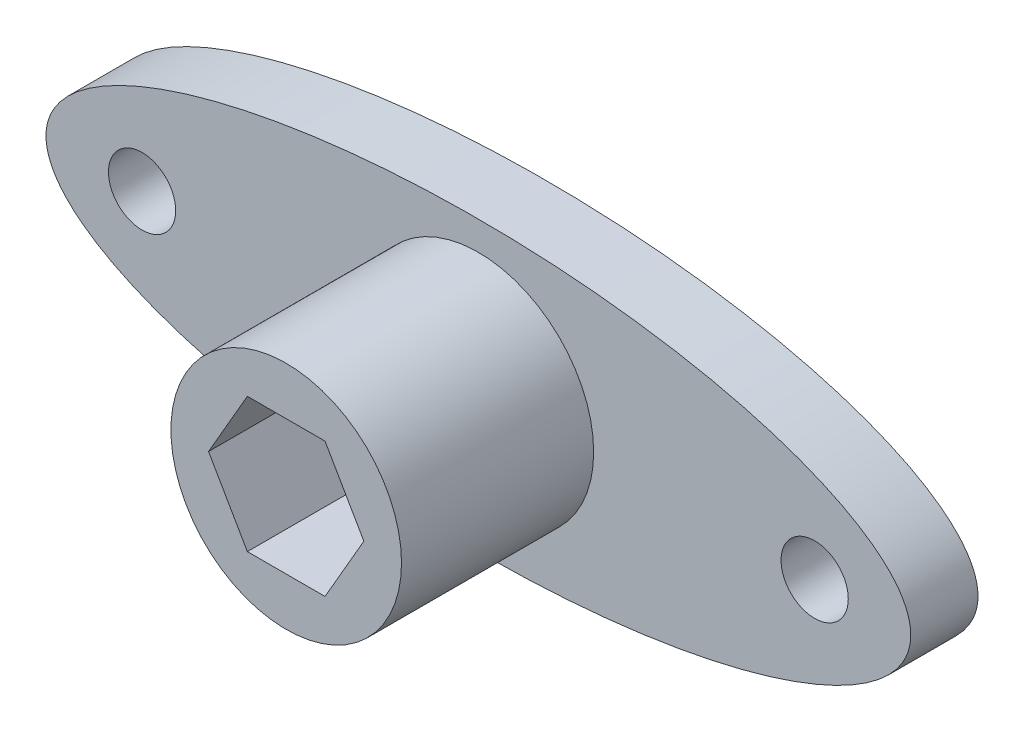
ISO-10303-21;
HEADER;
FILE_DESCRIPTION(('STEP AP214'),'2;1');
FILE_NAME('part.step','',(''),(''),'','','');
FILE_SCHEMA(('AUTOMOTIVE_DESIGN { 1 0 10303 214 1 1 1 1 }'));
ENDSEC;
DATA;
#1=APPLICATION_CONTEXT('core data for automotive mechanical design processes');
#2=APPLICATION_PROTOCOL_DEFINITION('international standard','automotive_design',2000,#1);
#3=PRODUCT_CONTEXT('',#1,'mechanical');
#4=PRODUCT('Part','Part','',(#3));
#5=PRODUCT_RELATED_PRODUCT_CATEGORY('part','',(#4));
#6=PRODUCT_DEFINITION_FORMATION('','',#4);
#7=PRODUCT_DEFINITION_CONTEXT('part definition',#1,'design');
#8=PRODUCT_DEFINITION('design','',#6,#7);
#9=PRODUCT_DEFINITION_SHAPE('','',#8);
#10=(LENGTH_UNIT() NAMED_UNIT(*) SI_UNIT(.MILLI.,.METRE.));
#11=(NAMED_UNIT(*) PLANE_ANGLE_UNIT() SI_UNIT($,.RADIAN.));
#12=(NAMED_UNIT(*) SI_UNIT($,.STERADIAN.) SOLID_ANGLE_UNIT());
#13=UNCERTAINTY_MEASURE_WITH_UNIT(LENGTH_MEASURE(1.E-05),#10,'distance_accuracy_value','');
#14=(GEOMETRIC_REPRESENTATION_CONTEXT(3) GLOBAL_UNCERTAINTY_ASSIGNED_CONTEXT((#13)) GLOBAL_UNIT_ASSIGNED_CONTEXT((#10,
#11,#12)) REPRESENTATION_CONTEXT('',''));
#15=CARTESIAN_POINT('',(0.,0.,0.));
#16=DIRECTION('',(0.,0.,1.));
#17=DIRECTION('',(1.,0.,0.));
#18=AXIS2_PLACEMENT_3D('',#15,#16,#17);
#19=CARTESIAN_POINT('',(0.,0.,3.5));
#20=DIRECTION('',(0.,0.,1.));
#21=DIRECTION('',(1.,0.,0.));
#22=AXIS2_PLACEMENT_3D('',#19,#20,#21);
#23=PLANE('',#22);
#24=CARTESIAN_POINT('',(0.,0.,3.5));
#25=DIRECTION('',(0.,0.,1.));
#26=DIRECTION('',(1.,0.,0.));
#27=AXIS2_PLACEMENT_3D('',#24,#25,#26);
#28=CIRCLE('',#27,6.);
#29=CARTESIAN_POINT('',(6.,0.,3.5));
#30=VERTEX_POINT('',#29);
#31=EDGE_CURVE('E164',#30,#30,#28,.T.);
#32=ORIENTED_EDGE('',*,*,#31,.F.);
#33=EDGE_LOOP('',(#32));
#34=FACE_BOUND('',#33,.T.);
#35=CARTESIAN_POINT('',(-17.5,0.,3.5));
#36=DIRECTION('',(0.,0.,1.));
#37=DIRECTION('',(1.,0.,0.));
#38=AXIS2_PLACEMENT_3D('',#35,#36,#37);
#39=CIRCLE('',#38,1.75);
#40=CARTESIAN_POINT('',(-15.75,0.,3.5));
#41=VERTEX_POINT('',#40);
#42=EDGE_CURVE('E181',#41,#41,#39,.T.);
#43=ORIENTED_EDGE('',*,*,#42,.F.);
#44=EDGE_LOOP('',(#43));
#45=FACE_BOUND('',#44,.T.);
#46=CARTESIAN_POINT('',(0.,0.,3.5));
#47=DIRECTION('',(0.,0.,1.));
#48=DIRECTION('',(1.,0.,0.));
#49=AXIS2_PLACEMENT_3D('',#46,#47,#48);
#50=ELLIPSE('',#49,22.5,7.5);
#51=CARTESIAN_POINT('',(22.5,0.,3.5));
#52=VERTEX_POINT('',#51);
#53=EDGE_CURVE('E13',#52,#52,#50,.T.);
#54=ORIENTED_EDGE('',*,*,#53,.T.);
#55=EDGE_LOOP('',(#54));
#56=FACE_BOUND('',#55,.T.);
#57=CARTESIAN_POINT('',(17.5,0.,3.5));
#58=DIRECTION('',(0.,0.,1.));
#59=DIRECTION('',(1.,0.,0.));
#60=AXIS2_PLACEMENT_3D('',#57,#58,#59);
#61=CIRCLE('',#60,1.75);
#62=CARTESIAN_POINT('',(19.25,0.,3.5));
#63=VERTEX_POINT('',#62);
#64=EDGE_CURVE('E173',#63,#63,#61,.T.);
#65=ORIENTED_EDGE('',*,*,#64,.F.);
#66=EDGE_LOOP('',(#65));
#67=FACE_BOUND('',#66,.T.);
#68=ADVANCED_FACE('F50',(#34,#45,#56,#67),#23,.T.);
#69=CARTESIAN_POINT('',(0.,0.,0.));
#70=DIRECTION('',(0.,0.,1.));
#71=DIRECTION('',(1.,0.,0.));
#72=AXIS2_PLACEMENT_3D('',#69,#70,#71);
#73=PLANE('',#72);
#74=CARTESIAN_POINT('',(0.,0.,0.));
#75=DIRECTION('',(0.,0.,1.));
#76=DIRECTION('',(1.,0.,0.));
#77=AXIS2_PLACEMENT_3D('',#74,#75,#76);
#78=ELLIPSE('',#77,22.5,7.5);
#79=CARTESIAN_POINT('',(22.5,0.,0.));
#80=VERTEX_POINT('',#79);
#81=EDGE_CURVE('E55',#80,#80,#78,.T.);
#82=ORIENTED_EDGE('',*,*,#81,.F.);
#83=EDGE_LOOP('',(#82));
#84=FACE_BOUND('',#83,.T.);
#85=CARTESIAN_POINT('',(-17.5,0.,0.));
#86=DIRECTION('',(0.,0.,1.));
#87=DIRECTION('',(1.,0.,0.));
#88=AXIS2_PLACEMENT_3D('',#85,#86,#87);
#89=CIRCLE('',#88,1.75);
#90=CARTESIAN_POINT('',(-15.75,0.,0.));
#91=VERTEX_POINT('',#90);
#92=EDGE_CURVE('E177',#91,#91,#89,.T.);
#93=ORIENTED_EDGE('',*,*,#92,.T.);
#94=EDGE_LOOP('',(#93));
#95=FACE_BOUND('',#94,.T.);
#96=CARTESIAN_POINT('',(17.5,0.,0.));
#97=DIRECTION('',(0.,0.,1.));
#98=DIRECTION('',(1.,0.,0.));
#99=AXIS2_PLACEMENT_3D('',#96,#97,#98);
#100=CIRCLE('',#99,1.75);
#101=CARTESIAN_POINT('',(19.25,0.,0.));
#102=VERTEX_POINT('',#101);
#103=EDGE_CURVE('E169',#102,#102,#100,.T.);
#104=ORIENTED_EDGE('',*,*,#103,.T.);
#105=EDGE_LOOP('',(#104));
#106=FACE_BOUND('',#105,.T.);
#107=ADVANCED_FACE('F190',(#84,#95,#106),#73,.F.);
#108=DIRECTION('',(0.,0.,-1.));
#109=VECTOR('',#108,1.);
#110=SURFACE_OF_LINEAR_EXTRUSION('',#50,#109);
#111=ORIENTED_EDGE('',*,*,#53,.F.);
#112=EDGE_LOOP('',(#111));
#113=FACE_BOUND('',#112,.T.);
#114=ORIENTED_EDGE('',*,*,#81,.T.);
#115=EDGE_LOOP('',(#114));
#116=FACE_BOUND('',#115,.T.);
#117=ADVANCED_FACE('F52',(#113,#116),#110,.F.);
#118=CARTESIAN_POINT('',(-17.5,0.,3.5));
#119=DIRECTION('',(0.,0.,-1.));
#120=DIRECTION('',(-1.,0.,0.));
#121=AXIS2_PLACEMENT_3D('',#118,#119,#120);
#122=CYLINDRICAL_SURFACE('',#121,1.75);
#123=ORIENTED_EDGE('',*,*,#42,.T.);
#124=EDGE_LOOP('',(#123));
#125=FACE_BOUND('',#124,.T.);
#126=ORIENTED_EDGE('',*,*,#92,.F.);
#127=EDGE_LOOP('',(#126));
#128=FACE_BOUND('',#127,.T.);
#129=ADVANCED_FACE('F193',(#125,#128),#122,.F.);
#130=CARTESIAN_POINT('',(17.5,0.,3.5));
#131=DIRECTION('',(0.,0.,-1.));
#132=DIRECTION('',(-1.,0.,0.));
#133=AXIS2_PLACEMENT_3D('',#130,#131,#132);
#134=CYLINDRICAL_SURFACE('',#133,1.75);
#135=ORIENTED_EDGE('',*,*,#64,.T.);
#136=EDGE_LOOP('',(#135));
#137=FACE_BOUND('',#136,.T.);
#138=ORIENTED_EDGE('',*,*,#103,.F.);
#139=EDGE_LOOP('',(#138));
#140=FACE_BOUND('',#139,.T.);
#141=ADVANCED_FACE('F195',(#137,#140),#134,.F.);
#142=CARTESIAN_POINT('',(0.,0.,13.5));
#143=DIRECTION('',(0.,0.,-1.));
#144=DIRECTION('',(-1.,0.,0.));
#145=AXIS2_PLACEMENT_3D('',#142,#143,#144);
#146=CYLINDRICAL_SURFACE('',#145,6.);
#147=CARTESIAN_POINT('',(0.,0.,13.5));
#148=DIRECTION('',(0.,0.,1.));
#149=DIRECTION('',(1.,0.,0.));
#150=AXIS2_PLACEMENT_3D('',#147,#148,#149);
#151=CIRCLE('',#150,6.);
#152=CARTESIAN_POINT('',(6.,0.,13.5));
#153=VERTEX_POINT('',#152);
#154=EDGE_CURVE('E165',#153,#153,#151,.T.);
#155=ORIENTED_EDGE('',*,*,#154,.F.);
#156=EDGE_LOOP('',(#155));
#157=FACE_BOUND('',#156,.T.);
#158=ORIENTED_EDGE('',*,*,#31,.T.);
#159=EDGE_LOOP('',(#158));
#160=FACE_BOUND('',#159,.T.);
#161=ADVANCED_FACE('F202',(#157,#160),#146,.T.);
#162=CARTESIAN_POINT('',(0.,0.,13.5));
#163=DIRECTION('',(0.,0.,1.));
#164=DIRECTION('',(1.,0.,0.));
#165=AXIS2_PLACEMENT_3D('',#162,#163,#164);
#166=PLANE('',#165);
#167=DIRECTION('',(0.5,0.866025403784439,0.));
#168=VECTOR('',#167,1.);
#169=CARTESIAN_POINT('',(2.02072594216369,-3.5,13.5));
#170=LINE('',#169,#168);
#171=CARTESIAN_POINT('',(2.02072594216369,-3.5,13.5));
#172=VERTEX_POINT('',#171);
#173=CARTESIAN_POINT('',(4.04145188432738,0.,13.5));
#174=VERTEX_POINT('',#173);
#175=EDGE_CURVE('E66',#172,#174,#170,.T.);
#176=ORIENTED_EDGE('',*,*,#175,.F.);
#177=DIRECTION('',(1.,0.,0.));
#178=VECTOR('',#177,1.);
#179=CARTESIAN_POINT('',(-2.02072594216369,-3.5,13.5));
#180=LINE('',#179,#178);
#181=CARTESIAN_POINT('',(-2.02072594216369,-3.5,13.5));
#182=VERTEX_POINT('',#181);
#183=EDGE_CURVE('E145',#182,#172,#180,.T.);
#184=ORIENTED_EDGE('',*,*,#183,.F.);
#185=DIRECTION('',(0.5,-0.866025403784438,0.));
#186=VECTOR('',#185,1.);
#187=CARTESIAN_POINT('',(-4.04145188432738,0.,13.5));
#188=LINE('',#187,#186);
#189=CARTESIAN_POINT('',(-4.04145188432738,0.,13.5));
#190=VERTEX_POINT('',#189);
#191=EDGE_CURVE('E138',#190,#182,#188,.T.);
#192=ORIENTED_EDGE('',*,*,#191,.F.);
#193=DIRECTION('',(-0.5,-0.866025403784439,0.));
#194=VECTOR('',#193,1.);
#195=CARTESIAN_POINT('',(-2.02072594216369,3.5,13.5));
#196=LINE('',#195,#194);
#197=CARTESIAN_POINT('',(-2.02072594216369,3.5,13.5));
#198=VERTEX_POINT('',#197);
#199=EDGE_CURVE('E134',#198,#190,#196,.T.);
#200=ORIENTED_EDGE('',*,*,#199,.F.);
#201=DIRECTION('',(-1.,0.,0.));
#202=VECTOR('',#201,1.);
#203=CARTESIAN_POINT('',(2.02072594216369,3.5,13.5));
#204=LINE('',#203,#202);
#205=CARTESIAN_POINT('',(2.02072594216369,3.5,13.5));
#206=VERTEX_POINT('',#205);
#207=EDGE_CURVE('E117',#206,#198,#204,.T.);
#208=ORIENTED_EDGE('',*,*,#207,.F.);
#209=DIRECTION('',(-0.5,0.866025403784439,0.));
#210=VECTOR('',#209,1.);
#211=CARTESIAN_POINT('',(4.04145188432738,0.,13.5));
#212=LINE('',#211,#210);
#213=EDGE_CURVE('E125',#174,#206,#212,.T.);
#214=ORIENTED_EDGE('',*,*,#213,.F.);
#215=EDGE_LOOP('',(#176,#184,#192,#200,#208,#214));
#216=FACE_BOUND('',#215,.T.);
#217=ORIENTED_EDGE('',*,*,#154,.T.);
#218=EDGE_LOOP('',(#217));
#219=FACE_BOUND('',#218,.T.);
#220=ADVANCED_FACE('F130',(#216,#219),#166,.T.);
#221=CARTESIAN_POINT('',(2.02072594216369,-3.5,-7.19267662156362));
#222=DIRECTION('',(0.866025403784439,-0.5,0.));
#223=DIRECTION('',(0.5,0.866025403784439,0.));
#224=AXIS2_PLACEMENT_3D('',#221,#222,#223);
#225=PLANE('',#224);
#226=DIRECTION('',(-0.5,-0.866025403784439,0.));
#227=VECTOR('',#226,1.);
#228=CARTESIAN_POINT('',(2.02072594216369,-3.5,6.5));
#229=LINE('',#228,#227);
#230=CARTESIAN_POINT('',(4.04145188432738,0.,6.5));
#231=VERTEX_POINT('',#230);
#232=CARTESIAN_POINT('',(2.02072594216369,-3.5,6.5));
#233=VERTEX_POINT('',#232);
#234=EDGE_CURVE('E85',#231,#233,#229,.T.);
#235=ORIENTED_EDGE('',*,*,#234,.T.);
#236=DIRECTION('',(0.,0.,1.));
#237=VECTOR('',#236,1.);
#238=CARTESIAN_POINT('',(2.02072594216369,-3.5,-7.19267662156362));
#239=LINE('',#238,#237);
#240=EDGE_CURVE('E149',#233,#172,#239,.T.);
#241=ORIENTED_EDGE('',*,*,#240,.T.);
#242=ORIENTED_EDGE('',*,*,#175,.T.);
#243=DIRECTION('',(0.,0.,1.));
#244=VECTOR('',#243,1.);
#245=CARTESIAN_POINT('',(4.04145188432738,0.,-7.19267662156362));
#246=LINE('',#245,#244);
#247=EDGE_CURVE('E122',#231,#174,#246,.T.);
#248=ORIENTED_EDGE('',*,*,#247,.F.);
#249=EDGE_LOOP('',(#235,#241,#242,#248));
#250=FACE_BOUND('',#249,.T.);
#251=ADVANCED_FACE('F233',(#250),#225,.F.);
#252=CARTESIAN_POINT('',(-2.02072594216369,-3.5,-7.19267662156362));
#253=DIRECTION('',(0.,-1.,0.));
#254=DIRECTION('',(1.,0.,0.));
#255=AXIS2_PLACEMENT_3D('',#252,#253,#254);
#256=PLANE('',#255);
#257=DIRECTION('',(-1.,0.,0.));
#258=VECTOR('',#257,1.);
#259=CARTESIAN_POINT('',(-2.02072594216369,-3.5,6.5));
#260=LINE('',#259,#258);
#261=CARTESIAN_POINT('',(-2.02072594216369,-3.5,6.5));
#262=VERTEX_POINT('',#261);
#263=EDGE_CURVE('E260',#233,#262,#260,.T.);
#264=ORIENTED_EDGE('',*,*,#263,.T.);
#265=DIRECTION('',(0.,0.,1.));
#266=VECTOR('',#265,1.);
#267=CARTESIAN_POINT('',(-2.02072594216369,-3.5,-7.19267662156362));
#268=LINE('',#267,#266);
#269=EDGE_CURVE('E152',#262,#182,#268,.T.);
#270=ORIENTED_EDGE('',*,*,#269,.T.);
#271=ORIENTED_EDGE('',*,*,#183,.T.);
#272=ORIENTED_EDGE('',*,*,#240,.F.);
#273=EDGE_LOOP('',(#264,#270,#271,#272));
#274=FACE_BOUND('',#273,.T.);
#275=ADVANCED_FACE('F239',(#274),#256,.F.);
#276=CARTESIAN_POINT('',(-4.04145188432738,0.,-7.19267662156362));
#277=DIRECTION('',(-0.866025403784439,-0.5,0.));
#278=DIRECTION('',(0.5,-0.866025403784439,0.));
#279=AXIS2_PLACEMENT_3D('',#276,#277,#278);
#280=PLANE('',#279);
#281=DIRECTION('',(-0.5,0.866025403784439,0.));
#282=VECTOR('',#281,1.);
#283=CARTESIAN_POINT('',(-4.04145188432738,0.,6.5));
#284=LINE('',#283,#282);
#285=CARTESIAN_POINT('',(-4.04145188432738,0.,6.5));
#286=VERTEX_POINT('',#285);
#287=EDGE_CURVE('E265',#262,#286,#284,.T.);
#288=ORIENTED_EDGE('',*,*,#287,.T.);
#289=DIRECTION('',(0.,0.,1.));
#290=VECTOR('',#289,1.);
#291=CARTESIAN_POINT('',(-4.04145188432738,0.,-7.19267662156362));
#292=LINE('',#291,#290);
#293=EDGE_CURVE('E155',#286,#190,#292,.T.);
#294=ORIENTED_EDGE('',*,*,#293,.T.);
#295=ORIENTED_EDGE('',*,*,#191,.T.);
#296=ORIENTED_EDGE('',*,*,#269,.F.);
#297=EDGE_LOOP('',(#288,#294,#295,#296));
#298=FACE_BOUND('',#297,.T.);
#299=ADVANCED_FACE('F248',(#298),#280,.F.);
#300=CARTESIAN_POINT('',(-2.02072594216369,3.5,-7.19267662156362));
#301=DIRECTION('',(-0.866025403784439,0.5,0.));
#302=DIRECTION('',(-0.5,-0.866025403784439,0.));
#303=AXIS2_PLACEMENT_3D('',#300,#301,#302);
#304=PLANE('',#303);
#305=DIRECTION('',(0.5,0.866025403784439,0.));
#306=VECTOR('',#305,1.);
#307=CARTESIAN_POINT('',(-2.02072594216369,3.5,6.5));
#308=LINE('',#307,#306);
#309=CARTESIAN_POINT('',(-2.02072594216369,3.5,6.5));
#310=VERTEX_POINT('',#309);
#311=EDGE_CURVE('E75',#286,#310,#308,.T.);
#312=ORIENTED_EDGE('',*,*,#311,.T.);
#313=DIRECTION('',(0.,0.,1.));
#314=VECTOR('',#313,1.);
#315=CARTESIAN_POINT('',(-2.02072594216369,3.5,-7.19267662156362));
#316=LINE('',#315,#314);
#317=EDGE_CURVE('E121',#310,#198,#316,.T.);
#318=ORIENTED_EDGE('',*,*,#317,.T.);
#319=ORIENTED_EDGE('',*,*,#199,.T.);
#320=ORIENTED_EDGE('',*,*,#293,.F.);
#321=EDGE_LOOP('',(#312,#318,#319,#320));
#322=FACE_BOUND('',#321,.T.);
#323=ADVANCED_FACE('F245',(#322),#304,.F.);
#324=CARTESIAN_POINT('',(2.02072594216369,3.5,-7.19267662156362));
#325=DIRECTION('',(0.,1.,0.));
#326=DIRECTION('',(0.,0.,1.));
#327=AXIS2_PLACEMENT_3D('',#324,#325,#326);
#328=PLANE('',#327);
#329=DIRECTION('',(1.,0.,0.));
#330=VECTOR('',#329,1.);
#331=CARTESIAN_POINT('',(2.02072594216369,3.5,6.5));
#332=LINE('',#331,#330);
#333=CARTESIAN_POINT('',(2.02072594216369,3.5,6.5));
#334=VERTEX_POINT('',#333);
#335=EDGE_CURVE('E119',#310,#334,#332,.T.);
#336=ORIENTED_EDGE('',*,*,#335,.T.);
#337=DIRECTION('',(0.,0.,1.));
#338=VECTOR('',#337,1.);
#339=CARTESIAN_POINT('',(2.02072594216369,3.5,-7.19267662156362));
#340=LINE('',#339,#338);
#341=EDGE_CURVE('E112',#334,#206,#340,.T.);
#342=ORIENTED_EDGE('',*,*,#341,.T.);
#343=ORIENTED_EDGE('',*,*,#207,.T.);
#344=ORIENTED_EDGE('',*,*,#317,.F.);
#345=EDGE_LOOP('',(#336,#342,#343,#344));
#346=FACE_BOUND('',#345,.T.);
#347=ADVANCED_FACE('F114',(#346),#328,.F.);
#348=CARTESIAN_POINT('',(4.04145188432738,0.,-7.19267662156362));
#349=DIRECTION('',(0.866025403784439,0.5,0.));
#350=DIRECTION('',(-0.5,0.866025403784439,0.));
#351=AXIS2_PLACEMENT_3D('',#348,#349,#350);
#352=PLANE('',#351);
#353=DIRECTION('',(0.5,-0.866025403784439,0.));
#354=VECTOR('',#353,1.);
#355=CARTESIAN_POINT('',(4.04145188432738,0.,6.5));
#356=LINE('',#355,#354);
#357=EDGE_CURVE('E94',#334,#231,#356,.T.);
#358=ORIENTED_EDGE('',*,*,#357,.T.);
#359=ORIENTED_EDGE('',*,*,#247,.T.);
#360=ORIENTED_EDGE('',*,*,#213,.T.);
#361=ORIENTED_EDGE('',*,*,#341,.F.);
#362=EDGE_LOOP('',(#358,#359,#360,#361));
#363=FACE_BOUND('',#362,.T.);
#364=ADVANCED_FACE('F126',(#363),#352,.F.);
#365=CARTESIAN_POINT('',(0.,0.,6.5));
#366=DIRECTION('',(0.,0.,1.));
#367=DIRECTION('',(1.,0.,0.));
#368=AXIS2_PLACEMENT_3D('',#365,#366,#367);
#369=PLANE('',#368);
#370=ORIENTED_EDGE('',*,*,#234,.F.);
#371=ORIENTED_EDGE('',*,*,#357,.F.);
#372=ORIENTED_EDGE('',*,*,#335,.F.);
#373=ORIENTED_EDGE('',*,*,#311,.F.);
#374=ORIENTED_EDGE('',*,*,#287,.F.);
#375=ORIENTED_EDGE('',*,*,#263,.F.);
#376=EDGE_LOOP('',(#370,#371,#372,#373,#374,#375));
#377=FACE_BOUND('',#376,.T.);
#378=ADVANCED_FACE('F242',(#377),#369,.T.);
#379=CLOSED_SHELL('',(#68,#107,#117,#129,#141,#161,#220,#251,#275,#299,#323,#347,#364,#378));
#380=MANIFOLD_SOLID_BREP('B2',#379);
#381=ADVANCED_BREP_SHAPE_REPRESENTATION('',(#18,#380),#14);
#382=SHAPE_DEFINITION_REPRESENTATION(#9,#381);
ENDSEC;
END-ISO-10303-21;
